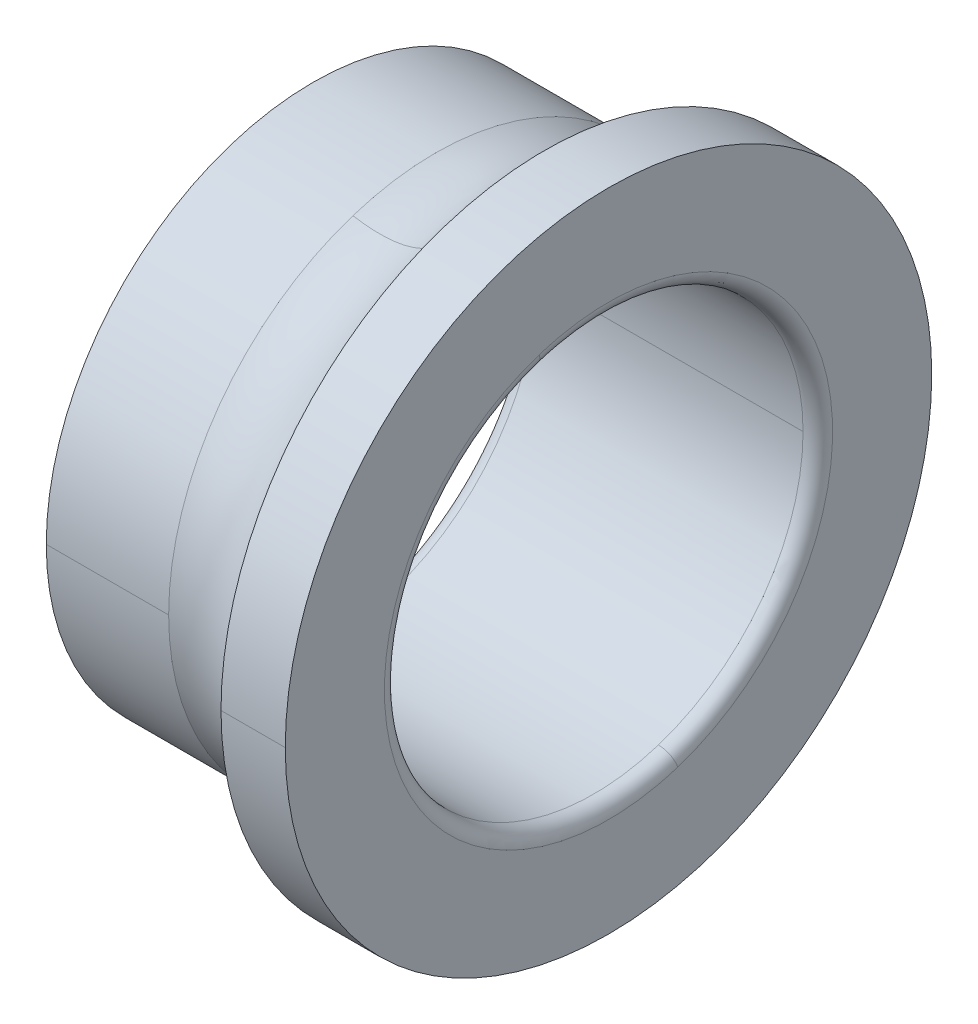
ISO-10303-21;
HEADER;
FILE_DESCRIPTION(('STEP AP214'),'2;1');
FILE_NAME('part.step','',(''),(''),'','','');
FILE_SCHEMA(('AUTOMOTIVE_DESIGN { 1 0 10303 214 1 1 1 1 }'));
ENDSEC;
DATA;
#1=APPLICATION_CONTEXT('core data for automotive mechanical design processes');
#2=APPLICATION_PROTOCOL_DEFINITION('international standard','automotive_design',2000,#1);
#3=PRODUCT_CONTEXT('',#1,'mechanical');
#4=PRODUCT('Part','Part','',(#3));
#5=PRODUCT_RELATED_PRODUCT_CATEGORY('part','',(#4));
#6=PRODUCT_DEFINITION_FORMATION('','',#4);
#7=PRODUCT_DEFINITION_CONTEXT('part definition',#1,'design');
#8=PRODUCT_DEFINITION('design','',#6,#7);
#9=PRODUCT_DEFINITION_SHAPE('','',#8);
#10=(LENGTH_UNIT() NAMED_UNIT(*) SI_UNIT(.MILLI.,.METRE.));
#11=(NAMED_UNIT(*) PLANE_ANGLE_UNIT() SI_UNIT($,.RADIAN.));
#12=(NAMED_UNIT(*) SI_UNIT($,.STERADIAN.) SOLID_ANGLE_UNIT());
#13=UNCERTAINTY_MEASURE_WITH_UNIT(LENGTH_MEASURE(1.E-05),#10,'distance_accuracy_value','');
#14=(GEOMETRIC_REPRESENTATION_CONTEXT(3) GLOBAL_UNCERTAINTY_ASSIGNED_CONTEXT((#13)) GLOBAL_UNIT_ASSIGNED_CONTEXT((#10,
#11,#12)) REPRESENTATION_CONTEXT('',''));
#15=CARTESIAN_POINT('',(0.,0.,0.));
#16=DIRECTION('',(0.,0.,1.));
#17=DIRECTION('',(1.,0.,0.));
#18=AXIS2_PLACEMENT_3D('',#15,#16,#17);
#19=CARTESIAN_POINT('',(12.,0.,0.));
#20=DIRECTION('',(1.,0.,0.));
#21=DIRECTION('',(0.,1.,0.));
#22=AXIS2_PLACEMENT_3D('',#19,#20,#21);
#23=CYLINDRICAL_SURFACE('',#22,10.83);
#24=DIRECTION('',(1.,0.,0.));
#25=VECTOR('',#24,1.);
#26=CARTESIAN_POINT('',(0.,0.,10.83));
#27=LINE('',#26,#25);
#28=CARTESIAN_POINT('',(0.,0.,10.83));
#29=VERTEX_POINT('',#28);
#30=CARTESIAN_POINT('',(4.969085842565,0.,10.83));
#31=VERTEX_POINT('',#30);
#32=EDGE_CURVE('E11',#29,#31,#27,.T.);
#33=ORIENTED_EDGE('',*,*,#32,.F.);
#34=CARTESIAN_POINT('',(0.,0.,0.));
#35=DIRECTION('',(1.,0.,0.));
#36=DIRECTION('',(0.,0.,-1.));
#37=AXIS2_PLACEMENT_3D('',#34,#35,#36);
#38=CIRCLE('',#37,10.83);
#39=CARTESIAN_POINT('',(0.,0.,-10.83));
#40=VERTEX_POINT('',#39);
#41=EDGE_CURVE('E25',#29,#40,#38,.T.);
#42=ORIENTED_EDGE('',*,*,#41,.T.);
#43=DIRECTION('',(1.,0.,0.));
#44=VECTOR('',#43,1.);
#45=CARTESIAN_POINT('',(0.,0.,-10.83));
#46=LINE('',#45,#44);
#47=CARTESIAN_POINT('',(4.969085842565,0.,-10.83));
#48=VERTEX_POINT('',#47);
#49=EDGE_CURVE('E379',#40,#48,#46,.T.);
#50=ORIENTED_EDGE('',*,*,#49,.T.);
#51=CARTESIAN_POINT('',(4.969085842565,0.,0.));
#52=DIRECTION('',(1.,0.,0.));
#53=DIRECTION('',(0.,0.,-1.));
#54=AXIS2_PLACEMENT_3D('',#51,#52,#53);
#55=CIRCLE('',#54,10.83);
#56=CARTESIAN_POINT('',(4.96908584256501,-10.2999420714765,-3.34665404908068));
#57=VERTEX_POINT('',#56);
#58=EDGE_CURVE('E373',#57,#48,#55,.T.);
#59=ORIENTED_EDGE('',*,*,#58,.F.);
#60=CARTESIAN_POINT('',(4.969085842565,0.,0.));
#61=DIRECTION('',(1.,0.,0.));
#62=DIRECTION('',(0.,0.,-1.));
#63=AXIS2_PLACEMENT_3D('',#60,#61,#62);
#64=CIRCLE('',#63,10.83);
#65=EDGE_CURVE('E367',#31,#57,#64,.T.);
#66=ORIENTED_EDGE('',*,*,#65,.F.);
#67=EDGE_LOOP('',(#33,#42,#50,#59,#66));
#68=FACE_BOUND('',#67,.T.);
#69=ADVANCED_FACE('F16',(#68),#23,.T.);
#70=CARTESIAN_POINT('',(5.99999999999977,0.,0.));
#71=DIRECTION('',(1.,0.,0.));
#72=DIRECTION('',(0.,0.309016994374947,-0.951056516295154));
#73=AXIS2_PLACEMENT_3D('',#70,#71,#72);
#74=TOROIDAL_SURFACE('',#73,14.2500000000004,3.57200000000031);
#75=CARTESIAN_POINT('',(5.99999999999977,-13.5525553572063,-4.40349216984313));
#76=DIRECTION('',(0.,0.309016994374947,-0.951056516295154));
#77=DIRECTION('',(-0.288609786515865,0.910586026240071,0.295867335039853));
#78=AXIS2_PLACEMENT_3D('',#75,#76,#77);
#79=CIRCLE('',#78,3.57200000000031);
#80=CARTESIAN_POINT('',(9.3902151849108,-12.4826167763739,-4.05584805117118));
#81=VERTEX_POINT('',#80);
#82=EDGE_CURVE('E362',#57,#81,#79,.T.);
#83=ORIENTED_EDGE('',*,*,#82,.T.);
#84=CARTESIAN_POINT('',(9.3902151849108,0.,0.));
#85=DIRECTION('',(1.,0.,0.));
#86=DIRECTION('',(0.,0.,-1.));
#87=AXIS2_PLACEMENT_3D('',#84,#85,#86);
#88=CIRCLE('',#87,13.125);
#89=CARTESIAN_POINT('',(9.3902151849108,0.,13.125));
#90=VERTEX_POINT('',#89);
#91=EDGE_CURVE('E135',#90,#81,#88,.T.);
#92=ORIENTED_EDGE('',*,*,#91,.F.);
#93=CARTESIAN_POINT('',(9.3902151849108,0.,0.));
#94=DIRECTION('',(1.,0.,0.));
#95=DIRECTION('',(0.,0.,-1.));
#96=AXIS2_PLACEMENT_3D('',#93,#94,#95);
#97=CIRCLE('',#96,13.125);
#98=CARTESIAN_POINT('',(9.3902151849108,12.4826167763739,4.05584805117119));
#99=VERTEX_POINT('',#98);
#100=EDGE_CURVE('E355',#99,#90,#97,.T.);
#101=ORIENTED_EDGE('',*,*,#100,.F.);
#102=CARTESIAN_POINT('',(5.99999999999977,13.5525553572063,4.40349216984313));
#103=DIRECTION('',(0.,-0.309016994374947,0.951056516295154));
#104=DIRECTION('',(-0.288609786515866,-0.91058602624007,-0.295867335039853));
#105=AXIS2_PLACEMENT_3D('',#102,#103,#104);
#106=CIRCLE('',#105,3.57200000000031);
#107=CARTESIAN_POINT('',(4.96908584256501,10.2999420714765,3.34665404908068));
#108=VERTEX_POINT('',#107);
#109=EDGE_CURVE('E146',#108,#99,#106,.T.);
#110=ORIENTED_EDGE('',*,*,#109,.F.);
#111=CARTESIAN_POINT('',(4.969085842565,0.,0.));
#112=DIRECTION('',(1.,0.,0.));
#113=DIRECTION('',(0.,0.,-1.));
#114=AXIS2_PLACEMENT_3D('',#111,#112,#113);
#115=CIRCLE('',#114,10.83);
#116=EDGE_CURVE('E346',#108,#31,#115,.T.);
#117=ORIENTED_EDGE('',*,*,#116,.T.);
#118=ORIENTED_EDGE('',*,*,#65,.T.);
#119=EDGE_LOOP('',(#83,#92,#101,#110,#117,#118));
#120=FACE_BOUND('',#119,.T.);
#121=ADVANCED_FACE('F432',(#120),#74,.F.);
#122=CARTESIAN_POINT('',(12.,0.,0.));
#123=DIRECTION('',(1.,0.,0.));
#124=DIRECTION('',(0.,-1.,0.));
#125=AXIS2_PLACEMENT_3D('',#122,#123,#124);
#126=CYLINDRICAL_SURFACE('',#125,10.83);
#127=ORIENTED_EDGE('',*,*,#32,.T.);
#128=ORIENTED_EDGE('',*,*,#116,.F.);
#129=CARTESIAN_POINT('',(4.969085842565,0.,0.));
#130=DIRECTION('',(1.,0.,0.));
#131=DIRECTION('',(0.,0.,-1.));
#132=AXIS2_PLACEMENT_3D('',#129,#130,#131);
#133=CIRCLE('',#132,10.83);
#134=EDGE_CURVE('E341',#48,#108,#133,.T.);
#135=ORIENTED_EDGE('',*,*,#134,.F.);
#136=ORIENTED_EDGE('',*,*,#49,.F.);
#137=CARTESIAN_POINT('',(0.,0.,0.));
#138=DIRECTION('',(1.,0.,0.));
#139=DIRECTION('',(0.,0.,-1.));
#140=AXIS2_PLACEMENT_3D('',#137,#138,#139);
#141=CIRCLE('',#140,10.83);
#142=EDGE_CURVE('E336',#40,#29,#141,.T.);
#143=ORIENTED_EDGE('',*,*,#142,.T.);
#144=EDGE_LOOP('',(#127,#128,#135,#136,#143));
#145=FACE_BOUND('',#144,.T.);
#146=ADVANCED_FACE('F316',(#145),#126,.T.);
#147=CARTESIAN_POINT('',(0.,10.83,0.));
#148=DIRECTION('',(-1.,0.,0.));
#149=DIRECTION('',(0.,0.,1.));
#150=AXIS2_PLACEMENT_3D('',#147,#148,#149);
#151=PLANE('',#150);
#152=CARTESIAN_POINT('',(0.,0.,0.));
#153=DIRECTION('',(1.,0.,0.));
#154=DIRECTION('',(0.,0.,-1.));
#155=AXIS2_PLACEMENT_3D('',#152,#153,#154);
#156=CIRCLE('',#155,9.1);
#157=CARTESIAN_POINT('',(0.,8.6546142982859,2.81205464881202));
#158=VERTEX_POINT('',#157);
#159=CARTESIAN_POINT('',(0.,-8.6546142982859,-2.81205464881202));
#160=VERTEX_POINT('',#159);
#161=EDGE_CURVE('E333',#158,#160,#156,.T.);
#162=ORIENTED_EDGE('',*,*,#161,.T.);
#163=CARTESIAN_POINT('',(0.,-8.6546142982859,-2.81205464881202));
#164=CARTESIAN_POINT('',(0.,-7.77035322156963,-5.52977285694612));
#165=CARTESIAN_POINT('',(0.,-5.82361355448477,-7.90801404603314));
#166=CARTESIAN_POINT('',(0.,-2.97302640379702,-9.35676213057699));
#167=CARTESIAN_POINT('',(0.,3.15812466204302,-9.71970828071693));
#168=CARTESIAN_POINT('',(0.,7.90499567495906,-5.82227850113272));
#169=CARTESIAN_POINT('',(0.,9.35961636543055,-2.97468359261989));
#170=CARTESIAN_POINT('',(0.,9.53666674238609,0.0936188124392139));
#171=CARTESIAN_POINT('',(0.,8.6546142982859,2.81205464881202));
#172=B_SPLINE_CURVE_WITH_KNOTS('',5,(#163,#164,#165,#166,#167,#168,#169,#170,#171),
.UNSPECIFIED.,.F.,.F.,(6,3,6),(0.,1.5707963267949,3.14159265358979),.UNSPECIFIED.);
#173=EDGE_CURVE('E331',#160,#158,#172,.T.);
#174=ORIENTED_EDGE('',*,*,#173,.T.);
#175=EDGE_LOOP('',(#162,#174));
#176=FACE_BOUND('',#175,.T.);
#177=ORIENTED_EDGE('',*,*,#41,.F.);
#178=ORIENTED_EDGE('',*,*,#142,.F.);
#179=EDGE_LOOP('',(#177,#178));
#180=FACE_BOUND('',#179,.T.);
#181=ADVANCED_FACE('F310',(#176,#180),#151,.T.);
#182=CARTESIAN_POINT('',(0.600000000000048,0.,0.));
#183=DIRECTION('',(1.,0.,0.));
#184=DIRECTION('',(0.,-0.309016994374947,0.951056516295154));
#185=AXIS2_PLACEMENT_3D('',#182,#183,#184);
#186=TOROIDAL_SURFACE('',#185,9.1,0.600000000000048);
#187=CARTESIAN_POINT('',(0.600000000000048,-8.6546142982859,-2.81205464881202));
#188=DIRECTION('',(0.,0.309016994374947,-0.951056516295154));
#189=DIRECTION('',(-1.,0.,0.));
#190=AXIS2_PLACEMENT_3D('',#187,#188,#189);
#191=CIRCLE('',#190,0.600000000000048);
#192=CARTESIAN_POINT('',(0.600000000000001,-8.08398038850876,-2.62664445218704));
#193=VERTEX_POINT('',#192);
#194=EDGE_CURVE('E393',#160,#193,#191,.T.);
#195=ORIENTED_EDGE('',*,*,#194,.T.);
#196=CARTESIAN_POINT('',(0.6,0.,0.));
#197=DIRECTION('',(1.,0.,0.));
#198=DIRECTION('',(0.,0.,-1.));
#199=AXIS2_PLACEMENT_3D('',#196,#197,#198);
#200=CIRCLE('',#199,8.5);
#201=CARTESIAN_POINT('',(0.6,0.,-8.5));
#202=VERTEX_POINT('',#201);
#203=EDGE_CURVE('E394',#193,#202,#200,.T.);
#204=ORIENTED_EDGE('',*,*,#203,.T.);
#205=CARTESIAN_POINT('',(0.6,0.,0.));
#206=DIRECTION('',(1.,0.,0.));
#207=DIRECTION('',(0.,0.,-1.));
#208=AXIS2_PLACEMENT_3D('',#205,#206,#207);
#209=CIRCLE('',#208,8.5);
#210=CARTESIAN_POINT('',(0.6,8.08398038850876,2.62664445218704));
#211=VERTEX_POINT('',#210);
#212=EDGE_CURVE('E395',#202,#211,#209,.T.);
#213=ORIENTED_EDGE('',*,*,#212,.T.);
#214=CARTESIAN_POINT('',(0.600000000000048,8.6546142982859,2.81205464881202));
#215=DIRECTION('',(0.,-0.309016994374947,0.951056516295154));
#216=DIRECTION('',(-1.,0.,0.));
#217=AXIS2_PLACEMENT_3D('',#214,#215,#216);
#218=CIRCLE('',#217,0.600000000000048);
#219=EDGE_CURVE('E290',#158,#211,#218,.T.);
#220=ORIENTED_EDGE('',*,*,#219,.F.);
#221=ORIENTED_EDGE('',*,*,#173,.F.);
#222=EDGE_LOOP('',(#195,#204,#213,#220,#221));
#223=FACE_BOUND('',#222,.T.);
#224=ADVANCED_FACE('F299',(#223),#186,.T.);
#225=CARTESIAN_POINT('',(0.600000000000048,0.,0.));
#226=DIRECTION('',(1.,0.,0.));
#227=DIRECTION('',(0.,0.309016994374947,-0.951056516295154));
#228=AXIS2_PLACEMENT_3D('',#225,#226,#227);
#229=TOROIDAL_SURFACE('',#228,9.1,0.600000000000048);
#230=ORIENTED_EDGE('',*,*,#194,.F.);
#231=ORIENTED_EDGE('',*,*,#161,.F.);
#232=ORIENTED_EDGE('',*,*,#219,.T.);
#233=CARTESIAN_POINT('',(0.6,0.,0.));
#234=DIRECTION('',(1.,0.,0.));
#235=DIRECTION('',(0.,0.,-1.));
#236=AXIS2_PLACEMENT_3D('',#233,#234,#235);
#237=CIRCLE('',#236,8.5);
#238=CARTESIAN_POINT('',(0.6,0.,8.5));
#239=VERTEX_POINT('',#238);
#240=EDGE_CURVE('E285',#211,#239,#237,.T.);
#241=ORIENTED_EDGE('',*,*,#240,.T.);
#242=CARTESIAN_POINT('',(0.6,0.,0.));
#243=DIRECTION('',(1.,0.,0.));
#244=DIRECTION('',(0.,0.,-1.));
#245=AXIS2_PLACEMENT_3D('',#242,#243,#244);
#246=CIRCLE('',#245,8.5);
#247=EDGE_CURVE('E279',#239,#193,#246,.T.);
#248=ORIENTED_EDGE('',*,*,#247,.T.);
#249=EDGE_LOOP('',(#230,#231,#232,#241,#248));
#250=FACE_BOUND('',#249,.T.);
#251=ADVANCED_FACE('F309',(#250),#229,.T.);
#252=CARTESIAN_POINT('',(12.,0.,0.));
#253=DIRECTION('',(1.,0.,0.));
#254=DIRECTION('',(0.,1.,0.));
#255=AXIS2_PLACEMENT_3D('',#252,#253,#254);
#256=CYLINDRICAL_SURFACE('',#255,8.5);
#257=DIRECTION('',(1.,0.,0.));
#258=VECTOR('',#257,1.);
#259=CARTESIAN_POINT('',(0.6,0.,8.5));
#260=LINE('',#259,#258);
#261=CARTESIAN_POINT('',(11.4,0.,8.5));
#262=VERTEX_POINT('',#261);
#263=EDGE_CURVE('E274',#239,#262,#260,.T.);
#264=ORIENTED_EDGE('',*,*,#263,.T.);
#265=CARTESIAN_POINT('',(11.4,0.,0.));
#266=DIRECTION('',(1.,0.,0.));
#267=DIRECTION('',(0.,0.,-1.));
#268=AXIS2_PLACEMENT_3D('',#265,#266,#267);
#269=CIRCLE('',#268,8.5);
#270=CARTESIAN_POINT('',(11.4,-8.08398038850888,-2.62664445218707));
#271=VERTEX_POINT('',#270);
#272=EDGE_CURVE('E270',#262,#271,#269,.T.);
#273=ORIENTED_EDGE('',*,*,#272,.T.);
#274=CARTESIAN_POINT('',(11.4,0.,0.));
#275=DIRECTION('',(1.,0.,0.));
#276=DIRECTION('',(0.,0.,-1.));
#277=AXIS2_PLACEMENT_3D('',#274,#275,#276);
#278=CIRCLE('',#277,8.5);
#279=CARTESIAN_POINT('',(11.4,0.,-8.5));
#280=VERTEX_POINT('',#279);
#281=EDGE_CURVE('E265',#271,#280,#278,.T.);
#282=ORIENTED_EDGE('',*,*,#281,.T.);
#283=DIRECTION('',(1.,0.,0.));
#284=VECTOR('',#283,1.);
#285=CARTESIAN_POINT('',(0.6,0.,-8.5));
#286=LINE('',#285,#284);
#287=EDGE_CURVE('E260',#202,#280,#286,.T.);
#288=ORIENTED_EDGE('',*,*,#287,.F.);
#289=ORIENTED_EDGE('',*,*,#203,.F.);
#290=ORIENTED_EDGE('',*,*,#247,.F.);
#291=EDGE_LOOP('',(#264,#273,#282,#288,#289,#290));
#292=FACE_BOUND('',#291,.T.);
#293=ADVANCED_FACE('F422',(#292),#256,.F.);
#294=CARTESIAN_POINT('',(12.,0.,0.));
#295=DIRECTION('',(1.,0.,0.));
#296=DIRECTION('',(0.,-1.,0.));
#297=AXIS2_PLACEMENT_3D('',#294,#295,#296);
#298=CYLINDRICAL_SURFACE('',#297,8.5);
#299=ORIENTED_EDGE('',*,*,#263,.F.);
#300=ORIENTED_EDGE('',*,*,#240,.F.);
#301=ORIENTED_EDGE('',*,*,#212,.F.);
#302=ORIENTED_EDGE('',*,*,#287,.T.);
#303=CARTESIAN_POINT('',(11.4,0.,0.));
#304=DIRECTION('',(1.,0.,0.));
#305=DIRECTION('',(0.,0.,-1.));
#306=AXIS2_PLACEMENT_3D('',#303,#304,#305);
#307=CIRCLE('',#306,8.5);
#308=CARTESIAN_POINT('',(11.4,8.08398038850888,2.62664445218708));
#309=VERTEX_POINT('',#308);
#310=EDGE_CURVE('E255',#280,#309,#307,.T.);
#311=ORIENTED_EDGE('',*,*,#310,.T.);
#312=CARTESIAN_POINT('',(11.4,0.,0.));
#313=DIRECTION('',(1.,0.,0.));
#314=DIRECTION('',(0.,0.,-1.));
#315=AXIS2_PLACEMENT_3D('',#312,#313,#314);
#316=CIRCLE('',#315,8.5);
#317=EDGE_CURVE('E249',#309,#262,#316,.T.);
#318=ORIENTED_EDGE('',*,*,#317,.T.);
#319=EDGE_LOOP('',(#299,#300,#301,#302,#311,#318));
#320=FACE_BOUND('',#319,.T.);
#321=ADVANCED_FACE('F417',(#320),#298,.F.);
#322=CARTESIAN_POINT('',(11.4,0.,0.));
#323=DIRECTION('',(1.,0.,0.));
#324=DIRECTION('',(0.,0.309016994374947,-0.951056516295154));
#325=AXIS2_PLACEMENT_3D('',#322,#323,#324);
#326=TOROIDAL_SURFACE('',#325,9.1,0.599999999999927);
#327=CARTESIAN_POINT('',(11.4,-8.6546142982859,-2.81205464881202));
#328=DIRECTION('',(0.,0.309016994374947,-0.951056516295154));
#329=DIRECTION('',(0.,0.951056516295154,0.309016994374947));
#330=AXIS2_PLACEMENT_3D('',#327,#328,#329);
#331=CIRCLE('',#330,0.599999999999927);
#332=CARTESIAN_POINT('',(11.9999999999999,-8.6546142982859,-2.81205464881202));
#333=VERTEX_POINT('',#332);
#334=EDGE_CURVE('E223',#271,#333,#331,.T.);
#335=ORIENTED_EDGE('',*,*,#334,.F.);
#336=ORIENTED_EDGE('',*,*,#272,.F.);
#337=ORIENTED_EDGE('',*,*,#317,.F.);
#338=CARTESIAN_POINT('',(11.4,8.6546142982859,2.81205464881202));
#339=DIRECTION('',(0.,-0.309016994374947,0.951056516295154));
#340=DIRECTION('',(0.,-0.951056516295154,-0.309016994374947));
#341=AXIS2_PLACEMENT_3D('',#338,#339,#340);
#342=CIRCLE('',#341,0.599999999999927);
#343=CARTESIAN_POINT('',(11.9999999999999,8.6546142982859,2.81205464881202));
#344=VERTEX_POINT('',#343);
#345=EDGE_CURVE('E219',#309,#344,#342,.T.);
#346=ORIENTED_EDGE('',*,*,#345,.T.);
#347=CARTESIAN_POINT('',(11.9999999999999,8.65461429828589,2.81205464881204));
#348=CARTESIAN_POINT('',(11.9999999999999,8.60860511914574,2.95366656315673));
#349=CARTESIAN_POINT('',(11.9999999999999,8.55911447032686,3.09414699684201));
#350=CARTESIAN_POINT('',(11.9999999999999,8.45330243894805,3.37251140646159));
#351=CARTESIAN_POINT('',(11.9999999999999,8.39698105638814,3.51039538239588));
#352=CARTESIAN_POINT('',(11.9999999999999,8.27763976314372,3.78323338008131));
#353=CARTESIAN_POINT('',(11.9999999999999,8.21461985245923,3.91818740183245));
#354=CARTESIAN_POINT('',(11.9999999999999,8.08203425525104,4.1848407292831));
#355=CARTESIAN_POINT('',(11.9999999999999,8.01246856872733,4.3165400349826));
#356=CARTESIAN_POINT('',(11.9999999999999,7.86695875999756,4.576366560262));
#357=CARTESIAN_POINT('',(11.9999999999999,7.79101463779149,4.70449377984189));
#358=CARTESIAN_POINT('',(11.9999999999999,7.63293098063957,4.9568674886172));
#359=CARTESIAN_POINT('',(11.9999999999999,7.55079144569371,5.08111397781262));
#360=CARTESIAN_POINT('',(11.9999999999999,7.38051482647062,5.32542689832994));
#361=CARTESIAN_POINT('',(11.9999999999999,7.29237774219337,5.44549332965184));
#362=CARTESIAN_POINT('',(11.9999999999999,7.11031835906663,5.68115688569824));
#363=CARTESIAN_POINT('',(11.9999999999999,7.01639606021713,5.79675401042276));
#364=CARTESIAN_POINT('',(11.9999999999999,6.82299251370341,6.02320046918661));
#365=CARTESIAN_POINT('',(11.9999999999999,6.7235112660392,6.13404980322595));
#366=CARTESIAN_POINT('',(11.9999999999999,6.51922948128005,6.35073363499558));
#367=CARTESIAN_POINT('',(11.9999999999999,6.41442894418512,6.45656813272588));
#368=CARTESIAN_POINT('',(11.9999999999999,6.19976105414544,6.66296732726726));
#369=CARTESIAN_POINT('',(11.9999999999999,6.08989370120069,6.76353202407835));
#370=CARTESIAN_POINT('',(11.9999999999999,5.86535685956264,6.95914934762769));
#371=CARTESIAN_POINT('',(11.9999999999999,5.75068737086933,7.05420197436594));
#372=CARTESIAN_POINT('',(11.9999999999999,5.51682250656963,7.23856616766363));
#373=CARTESIAN_POINT('',(11.9999999999999,5.39762713096324,7.32787773422308));
#374=CARTESIAN_POINT('',(11.9999999999999,5.15499764493929,7.50054464777724));
#375=CARTESIAN_POINT('',(11.9999999999999,5.03156353452172,7.58389999477195));
#376=CARTESIAN_POINT('',(11.9999999999999,4.78075394245847,7.74445365886448));
#377=CARTESIAN_POINT('',(11.9999999999999,4.65337846081279,7.82165197596229));
#378=CARTESIAN_POINT('',(11.9999999999999,4.3949929849855,7.96970560275342));
#379=CARTESIAN_POINT('',(11.9999999999999,4.2639829908039,8.04056091244673));
#380=CARTESIAN_POINT('',(11.9999999999999,3.99864410445583,8.17575782778158));
#381=CARTESIAN_POINT('',(11.9999999999999,3.86431521228938,8.24009943342312));
#382=CARTESIAN_POINT('',(11.9999999999999,3.59266214003866,8.3621139360908));
#383=CARTESIAN_POINT('',(11.9999999999999,3.45533795995441,8.41978683311693));
#384=CARTESIAN_POINT('',(11.9999999999999,3.1780251378461,8.5283249794933));
#385=CARTESIAN_POINT('',(11.9999999999999,3.03803649582205,8.57919022884354));
#386=CARTESIAN_POINT('',(11.9999999999999,2.75573199473434,8.67399054102716));
#387=CARTESIAN_POINT('',(11.9999999999999,2.61341613567068,8.71792560386054));
#388=CARTESIAN_POINT('',(11.9999999999999,2.32680005187365,8.79875969959584));
#389=CARTESIAN_POINT('',(11.9999999999999,2.18249982714027,8.83565873249775));
#390=CARTESIAN_POINT('',(11.9999999999999,1.89226264388438,8.90233187536787));
#391=CARTESIAN_POINT('',(11.9999999999999,1.74632568536187,8.93210598533607));
#392=CARTESIAN_POINT('',(11.9999999999999,1.45316660944336,8.98445755389996));
#393=CARTESIAN_POINT('',(11.9999999999999,1.30594449204736,9.00703501249564));
#394=CARTESIAN_POINT('',(11.9999999999999,1.01056976935783,9.04493888723916));
#395=CARTESIAN_POINT('',(11.9999999999999,0.862417164064294,9.060265303387));
#396=CARTESIAN_POINT('',(11.9999999999999,0.565538378182463,9.08363017055592));
#397=CARTESIAN_POINT('',(11.9999999999999,0.41681219759417,9.091668621577));
#398=CARTESIAN_POINT('',(11.9999999999999,0.119144555518741,9.10043819315979));
#399=CARTESIAN_POINT('',(11.9999999999999,-0.0297969059683946,9.1011693137215));
#400=CARTESIAN_POINT('',(11.9999999999999,-0.327536296815056,9.09532246305208));
#401=CARTESIAN_POINT('',(11.9999999999999,-0.476334226174581,9.08874449182095));
#402=CARTESIAN_POINT('',(11.9999999999999,-0.773428085521034,9.06829530447473));
#403=CARTESIAN_POINT('',(11.9999999999999,-0.921724015507962,9.05442408835962));
#404=CARTESIAN_POINT('',(11.9999999999999,-1.21745661822469,9.01942182822004));
#405=CARTESIAN_POINT('',(11.9999999999999,-1.3648932909545,8.99829078419555));
#406=CARTESIAN_POINT('',(11.9999999999999,-1.65855219129844,8.94881977477311));
#407=CARTESIAN_POINT('',(11.9999999999999,-1.80477441891259,8.92047980937516));
#408=CARTESIAN_POINT('',(11.9999999999999,-2.09565216687134,8.85665923066472));
#409=CARTESIAN_POINT('',(11.9999999999999,-2.24030768721596,8.82117861735223));
#410=CARTESIAN_POINT('',(11.9999999999999,-2.5277035328168,8.74316221871793));
#411=CARTESIAN_POINT('',(11.9999999999999,-2.67044385807303,8.70062643339611));
#412=CARTESIAN_POINT('',(11.9999999999999,-2.95366543955102,8.60860216317568));
#413=CARTESIAN_POINT('',(11.9999999999999,-3.09414669577276,8.55911367827707));
#414=CARTESIAN_POINT('',(11.9999999999999,-3.37251170753082,8.45330323099785));
#415=CARTESIAN_POINT('',(11.9999999999999,-3.51039546306713,8.39698126861724));
#416=CARTESIAN_POINT('',(11.9999999999999,-3.78323329941004,8.27763955091463));
#417=CARTESIAN_POINT('',(11.9999999999999,-3.91818738021664,8.21461979559262));
#418=CARTESIAN_POINT('',(11.9999999999999,-4.18484075089888,8.08203431211766));
#419=CARTESIAN_POINT('',(11.9999999999999,-4.31654004077453,8.01246858396471));
#420=CARTESIAN_POINT('',(11.9999999999999,-4.57636655447005,7.8669587447602));
#421=CARTESIAN_POINT('',(11.9999999999999,-4.70449377828993,7.79101463370866));
#422=CARTESIAN_POINT('',(11.9999999999999,-4.95686749016913,7.63293098472241));
#423=CARTESIAN_POINT('',(11.9999999999999,-5.08111397822846,7.55079144678772));
#424=CARTESIAN_POINT('',(11.9999999999999,-5.32542689791409,7.38051482537663));
#425=CARTESIAN_POINT('',(11.9999999999999,-5.4454933295404,7.29237774190024));
#426=CARTESIAN_POINT('',(11.9999999999999,-5.68115688580966,7.11031835935977));
#427=CARTESIAN_POINT('',(11.9999999999999,-5.7967540104526,7.01639606029568));
#428=CARTESIAN_POINT('',(11.9999999999999,-6.02320046915674,6.82299251362488));
#429=CARTESIAN_POINT('',(11.9999999999999,-6.13404980321794,6.72351126601816));
#430=CARTESIAN_POINT('',(11.9999999999999,-6.35073363500357,6.5192294813011));
#431=CARTESIAN_POINT('',(11.9999999999999,-6.45656813272801,6.41442894419076));
#432=CARTESIAN_POINT('',(11.9999999999999,-6.66296732726511,6.19976105413981));
#433=CARTESIAN_POINT('',(11.9999999999999,-6.76353202407777,6.08989370119919));
#434=CARTESIAN_POINT('',(11.9999999999999,-6.95914934762826,5.86535685956416));
#435=CARTESIAN_POINT('',(11.9999999999999,-7.05420197436608,5.75068737086975));
#436=CARTESIAN_POINT('',(11.9999999999999,-7.23856616766347,5.51682250656924));
#437=CARTESIAN_POINT('',(11.9999999999999,-7.32787773422303,5.39762713096315));
#438=CARTESIAN_POINT('',(11.9999999999999,-7.50054464777727,5.15499764493941));
#439=CARTESIAN_POINT('',(11.9999999999999,-7.58389999477195,5.03156353452176));
#440=CARTESIAN_POINT('',(11.9999999999999,-7.74445365886446,4.78075394245845));
#441=CARTESIAN_POINT('',(11.9999999999999,-7.82165197596228,4.65337846081279));
#442=CARTESIAN_POINT('',(11.9999999999999,-7.96970560275342,4.39499298498552));
#443=CARTESIAN_POINT('',(11.9999999999999,-8.04056091244673,4.26398299080391));
#444=CARTESIAN_POINT('',(11.9999999999999,-8.17575782778157,3.99864410445584));
#445=CARTESIAN_POINT('',(11.9999999999999,-8.24009943342311,3.86431521228939));
#446=CARTESIAN_POINT('',(11.9999999999999,-8.3621139360908,3.59266214003867));
#447=CARTESIAN_POINT('',(11.9999999999999,-8.41978683311696,3.45533795995441));
#448=CARTESIAN_POINT('',(11.9999999999999,-8.52832497949327,3.17802513784612));
#449=CARTESIAN_POINT('',(11.9999999999999,-8.57919022884342,3.03803649582209));
#450=CARTESIAN_POINT('',(11.9999999999999,-8.67399054102727,2.75573199473432));
#451=CARTESIAN_POINT('',(11.9999999999999,-8.71792560386096,2.61341613567058));
#452=CARTESIAN_POINT('',(11.9999999999999,-8.79875969959542,2.32680005187377));
#453=CARTESIAN_POINT('',(11.9999999999999,-8.83565873249619,2.1824998271407));
#454=CARTESIAN_POINT('',(11.9999999999999,-8.90233187536943,1.89226264388397));
#455=CARTESIAN_POINT('',(11.9999999999999,-8.9321059853419,1.7463256853603));
#456=CARTESIAN_POINT('',(11.9999999999999,-8.98445755389413,1.45316660944496));
#457=CARTESIAN_POINT('',(11.9999999999999,-9.00703501247391,1.30594449205328));
#458=CARTESIAN_POINT('',(11.9999999999999,-9.04493888726089,1.01056976935195));
#459=CARTESIAN_POINT('',(11.9999999999999,-9.0602653034681,0.862417164042297));
#460=CARTESIAN_POINT('',(11.9999999999999,-9.08363017047483,0.565538378204493));
#461=CARTESIAN_POINT('',(11.9999999999999,-9.09166862127435,0.416812197676342));
#462=CARTESIAN_POINT('',(11.9999999999999,-9.10043819346243,0.119144555436602));
#463=CARTESIAN_POINT('',(11.9999999999999,-9.10116931485098,-0.0297969062749878));
#464=CARTESIAN_POINT('',(11.9999999999999,-9.0953224619226,-0.327536296508429));
#465=CARTESIAN_POINT('',(11.9999999999999,-9.08874448760566,-0.476334225030281));
#466=CARTESIAN_POINT('',(11.9999999999999,-9.06829530869003,-0.773428086665303));
#467=CARTESIAN_POINT('',(11.9999999999999,-9.05442410409133,-0.921724019778474));
#468=CARTESIAN_POINT('',(11.9999999999999,-9.01942181248834,-1.21745661395416));
#469=CARTESIAN_POINT('',(11.9999999999999,-8.99829072548404,-1.36489327501668));
#470=CARTESIAN_POINT('',(11.9999999999999,-8.94881983348462,-1.65855220723624));
#471=CARTESIAN_POINT('',(11.9999999999999,-8.92048002848949,-1.80477447839329));
#472=CARTESIAN_POINT('',(11.9999999999999,-8.85665901155039,-2.09565210739062));
#473=CARTESIAN_POINT('',(11.9999999999999,-8.82117779960643,-2.24030746523089));
#474=CARTESIAN_POINT('',(11.9999999999999,-8.74316303646373,-2.52770375480184));
#475=CARTESIAN_POINT('',(11.9999999999999,-8.700629485265,-2.67044468653252));
#476=CARTESIAN_POINT('',(11.9999999999999,-8.6546142982859,-2.81205464881201));
#477=B_SPLINE_CURVE_WITH_KNOTS('',3,(#347,#348,#349,#350,#351,#352,#353,#354,#355,#356,#357,
#358,#359,#360,#361,#362,#363,#364,#365,#366,#367,#368,#369,#370,#371,#372,#373,#374,#375,#376,
#377,#378,#379,#380,#381,#382,#383,#384,#385,#386,#387,#388,#389,#390,#391,#392,#393,#394,#395,
#396,#397,#398,#399,#400,#401,#402,#403,#404,#405,#406,#407,#408,#409,#410,#411,#412,#413,#414,
#415,#416,#417,#418,#419,#420,#421,#422,#423,#424,#425,#426,#427,#428,#429,#430,#431,#432,#433,
#434,#435,#436,#437,#438,#439,#440,#441,#442,#443,#444,#445,#446,#447,#448,#449,#450,#451,#452,
#453,#454,#455,#456,#457,#458,#459,#460,#461,#462,#463,#464,#465,#466,#467,#468,#469,#470,#471,
#472,#473,#474,#475,#476),.UNSPECIFIED.,.F.,.F.,(4,2,2,2,2,2,2,2,2,2,2,2,2,2,2,2,2,2,2,2,2,2,2,
2,2,2,2,2,2,2,2,2,2,2,2,2,2,2,2,2,2,2,2,2,2,2,2,2,2,2,2,2,2,2,2,2,2,2,2,2,2,2,2,2,4),(0.,
0.446650359117002,0.893300718234006,1.33995107735101,1.78660143646801,2.23325179558501,
2.67990215470202,3.12655251381902,3.57320287293603,4.01985323205303,4.46650359117003,
4.91315395028704,5.35980430940404,5.80645466852104,6.25310502763804,6.69975538675505,
7.14640574587205,7.59305610498905,8.03970646410606,8.48635682322306,8.93300718234006,
9.37965754145707,9.82630790057408,10.2729582596911,10.7196086188081,11.1662589779251,
11.6129093370421,12.0595596961591,12.5062100552761,12.9528604143931,13.3995107735101,
13.8461611326271,14.2928114917441,14.7394618508611,15.1861122099781,15.6327625690951,
16.0794129282121,16.5260632873291,16.9727136464461,17.4193640055631,17.8660143646801,
18.3126647237971,18.7593150829141,19.2059654420311,19.6526158011481,20.0992661602651,
20.5459165193821,20.9925668784992,21.4392172376162,21.8858675967332,22.3325179558502,
22.7791683149672,23.2258186740842,23.6724690332012,24.1191193923182,24.5657697514352,
25.0124201105522,25.4590704696692,25.9057208287862,26.3523711879032,26.7990215470202,
27.2456719061372,27.6923222652542,28.1389726243712,28.5856229834882),.UNSPECIFIED.);
#478=EDGE_CURVE('E213',#344,#333,#477,.T.);
#479=ORIENTED_EDGE('',*,*,#478,.T.);
#480=EDGE_LOOP('',(#335,#336,#337,#346,#479));
#481=FACE_BOUND('',#480,.T.);
#482=ADVANCED_FACE('F193',(#481),#326,.T.);
#483=CARTESIAN_POINT('',(12.,9.1,0.));
#484=DIRECTION('',(1.,0.,0.));
#485=DIRECTION('',(0.,0.,-1.));
#486=AXIS2_PLACEMENT_3D('',#483,#484,#485);
#487=PLANE('',#486);
#488=CARTESIAN_POINT('',(12.,0.,0.));
#489=DIRECTION('',(1.,0.,0.));
#490=DIRECTION('',(0.,0.,-1.));
#491=AXIS2_PLACEMENT_3D('',#488,#489,#490);
#492=CIRCLE('',#491,13.125);
#493=CARTESIAN_POINT('',(12.,0.,-13.125));
#494=VERTEX_POINT('',#493);
#495=CARTESIAN_POINT('',(12.,0.,13.125));
#496=VERTEX_POINT('',#495);
#497=EDGE_CURVE('E154',#494,#496,#492,.T.);
#498=ORIENTED_EDGE('',*,*,#497,.T.);
#499=CARTESIAN_POINT('',(12.,0.,0.));
#500=DIRECTION('',(1.,0.,0.));
#501=DIRECTION('',(0.,0.,-1.));
#502=AXIS2_PLACEMENT_3D('',#499,#500,#501);
#503=CIRCLE('',#502,13.125);
#504=EDGE_CURVE('E226',#496,#494,#503,.T.);
#505=ORIENTED_EDGE('',*,*,#504,.T.);
#506=EDGE_LOOP('',(#498,#505));
#507=FACE_BOUND('',#506,.T.);
#508=CARTESIAN_POINT('',(11.9999999999999,-8.65461429828589,-2.81205464881204));
#509=CARTESIAN_POINT('',(11.9999999999999,-8.60860511914574,-2.95366656315673));
#510=CARTESIAN_POINT('',(11.9999999999999,-8.55911447032686,-3.09414699684201));
#511=CARTESIAN_POINT('',(11.9999999999999,-8.45330243894805,-3.37251140646159));
#512=CARTESIAN_POINT('',(11.9999999999999,-8.39698105638814,-3.51039538239588));
#513=CARTESIAN_POINT('',(11.9999999999999,-8.27763976314372,-3.78323338008131));
#514=CARTESIAN_POINT('',(11.9999999999999,-8.21461985245923,-3.91818740183245));
#515=CARTESIAN_POINT('',(11.9999999999999,-8.08203425525104,-4.18484072928309));
#516=CARTESIAN_POINT('',(11.9999999999999,-8.01246856872733,-4.3165400349826));
#517=CARTESIAN_POINT('',(11.9999999999999,-7.86695875999756,-4.576366560262));
#518=CARTESIAN_POINT('',(11.9999999999999,-7.79101463779149,-4.70449377984189));
#519=CARTESIAN_POINT('',(11.9999999999999,-7.63293098063957,-4.9568674886172));
#520=CARTESIAN_POINT('',(11.9999999999999,-7.55079144569372,-5.08111397781262));
#521=CARTESIAN_POINT('',(11.9999999999999,-7.38051482647062,-5.32542689832994));
#522=CARTESIAN_POINT('',(11.9999999999999,-7.29237774219337,-5.44549332965183));
#523=CARTESIAN_POINT('',(11.9999999999999,-7.11031835906663,-5.68115688569824));
#524=CARTESIAN_POINT('',(11.9999999999999,-7.01639606021713,-5.79675401042275));
#525=CARTESIAN_POINT('',(11.9999999999999,-6.82299251370342,-6.0232004691866));
#526=CARTESIAN_POINT('',(11.9999999999999,-6.7235112660392,-6.13404980322594));
#527=CARTESIAN_POINT('',(11.9999999999999,-6.51922948128005,-6.35073363499558));
#528=CARTESIAN_POINT('',(11.9999999999999,-6.41442894418512,-6.45656813272587));
#529=CARTESIAN_POINT('',(11.9999999999999,-6.19976105414544,-6.66296732726726));
#530=CARTESIAN_POINT('',(11.9999999999999,-6.0898937012007,-6.76353202407835));
#531=CARTESIAN_POINT('',(11.9999999999999,-5.86535685956264,-6.95914934762768));
#532=CARTESIAN_POINT('',(11.9999999999999,-5.75068737086933,-7.05420197436593));
#533=CARTESIAN_POINT('',(11.9999999999999,-5.51682250656963,-7.23856616766363));
#534=CARTESIAN_POINT('',(11.9999999999999,-5.39762713096325,-7.32787773422308));
#535=CARTESIAN_POINT('',(11.9999999999999,-5.15499764493929,-7.50054464777724));
#536=CARTESIAN_POINT('',(11.9999999999999,-5.03156353452172,-7.58389999477195));
#537=CARTESIAN_POINT('',(11.9999999999999,-4.78075394245847,-7.74445365886447));
#538=CARTESIAN_POINT('',(11.9999999999999,-4.65337846081279,-7.82165197596229));
#539=CARTESIAN_POINT('',(11.9999999999999,-4.39499298498551,-7.96970560275341));
#540=CARTESIAN_POINT('',(11.9999999999999,-4.2639829908039,-8.04056091244672));
#541=CARTESIAN_POINT('',(11.9999999999999,-3.99864410445584,-8.17575782778157));
#542=CARTESIAN_POINT('',(11.9999999999999,-3.86431521228938,-8.24009943342312));
#543=CARTESIAN_POINT('',(11.9999999999999,-3.59266214003867,-8.3621139360908));
#544=CARTESIAN_POINT('',(11.9999999999999,-3.45533795995441,-8.41978683311693));
#545=CARTESIAN_POINT('',(11.9999999999999,-3.17802513784611,-8.52832497949329));
#546=CARTESIAN_POINT('',(11.9999999999999,-3.03803649582205,-8.57919022884353));
#547=CARTESIAN_POINT('',(11.9999999999999,-2.75573199473435,-8.67399054102716));
#548=CARTESIAN_POINT('',(11.9999999999999,-2.61341613567069,-8.71792560386054));
#549=CARTESIAN_POINT('',(11.9999999999999,-2.32680005187366,-8.79875969959584));
#550=CARTESIAN_POINT('',(11.9999999999999,-2.18249982714028,-8.83565873249775));
#551=CARTESIAN_POINT('',(11.9999999999999,-1.89226264388439,-8.90233187536787));
#552=CARTESIAN_POINT('',(11.9999999999999,-1.74632568536188,-8.93210598533607));
#553=CARTESIAN_POINT('',(11.9999999999999,-1.45316660944338,-8.98445755389995));
#554=CARTESIAN_POINT('',(11.9999999999999,-1.30594449204738,-9.00703501249563));
#555=CARTESIAN_POINT('',(11.9999999999999,-1.01056976935785,-9.04493888723916));
#556=CARTESIAN_POINT('',(11.9999999999999,-0.862417164064308,-9.060265303387));
#557=CARTESIAN_POINT('',(11.9999999999999,-0.565538378182475,-9.08363017055592));
#558=CARTESIAN_POINT('',(11.9999999999999,-0.41681219759418,-9.091668621577));
#559=CARTESIAN_POINT('',(11.9999999999999,-0.119144555518751,-9.10043819315979));
#560=CARTESIAN_POINT('',(11.9999999999999,0.0297969059683832,-9.1011693137215));
#561=CARTESIAN_POINT('',(11.9999999999999,0.327536296815044,-9.09532246305208));
#562=CARTESIAN_POINT('',(11.9999999999999,0.476334226174571,-9.08874449182095));
#563=CARTESIAN_POINT('',(11.9999999999999,0.773428085521023,-9.06829530447473));
#564=CARTESIAN_POINT('',(11.9999999999999,0.92172401550795,-9.05442408835962));
#565=CARTESIAN_POINT('',(11.9999999999999,1.21745661822468,-9.01942182822004));
#566=CARTESIAN_POINT('',(11.9999999999999,1.36489329095448,-8.99829078419555));
#567=CARTESIAN_POINT('',(11.9999999999999,1.65855219129843,-8.94881977477311));
#568=CARTESIAN_POINT('',(11.9999999999999,1.80477441891258,-8.92047980937516));
#569=CARTESIAN_POINT('',(11.9999999999999,2.09565216687133,-8.85665923066472));
#570=CARTESIAN_POINT('',(11.9999999999999,2.24030768721594,-8.82117861735224));
#571=CARTESIAN_POINT('',(11.9999999999999,2.52770353281678,-8.74316221871793));
#572=CARTESIAN_POINT('',(11.9999999999999,2.67044385807302,-8.70062643339612));
#573=CARTESIAN_POINT('',(11.9999999999999,2.953665439551,-8.60860216317569));
#574=CARTESIAN_POINT('',(11.9999999999999,3.09414669577275,-8.55911367827708));
#575=CARTESIAN_POINT('',(11.9999999999999,3.37251170753081,-8.45330323099786));
#576=CARTESIAN_POINT('',(11.9999999999999,3.51039546306712,-8.39698126861725));
#577=CARTESIAN_POINT('',(11.9999999999999,3.78323329941003,-8.27763955091463));
#578=CARTESIAN_POINT('',(11.9999999999999,3.91818738021663,-8.21461979559263));
#579=CARTESIAN_POINT('',(11.9999999999999,4.18484075089887,-8.08203431211767));
#580=CARTESIAN_POINT('',(11.9999999999999,4.31654004077452,-8.01246858396471));
#581=CARTESIAN_POINT('',(11.9999999999999,4.57636655447004,-7.86695874476021));
#582=CARTESIAN_POINT('',(11.9999999999999,4.70449377828992,-7.79101463370866));
#583=CARTESIAN_POINT('',(11.9999999999999,4.95686749016913,-7.63293098472242));
#584=CARTESIAN_POINT('',(11.9999999999999,5.08111397822845,-7.55079144678772));
#585=CARTESIAN_POINT('',(11.9999999999999,5.32542689791408,-7.38051482537664));
#586=CARTESIAN_POINT('',(11.9999999999999,5.44549332954039,-7.29237774190025));
#587=CARTESIAN_POINT('',(11.9999999999999,5.68115688580965,-7.11031835935978));
#588=CARTESIAN_POINT('',(11.9999999999999,5.79675401045259,-7.01639606029569));
#589=CARTESIAN_POINT('',(11.9999999999999,6.02320046915673,-6.82299251362489));
#590=CARTESIAN_POINT('',(11.9999999999999,6.13404980321792,-6.72351126601817));
#591=CARTESIAN_POINT('',(11.9999999999999,6.35073363500356,-6.51922948130111));
#592=CARTESIAN_POINT('',(11.9999999999999,6.456568132728,-6.41442894419078));
#593=CARTESIAN_POINT('',(11.9999999999999,6.6629673272651,-6.19976105413982));
#594=CARTESIAN_POINT('',(11.9999999999999,6.76353202407776,-6.08989370119921));
#595=CARTESIAN_POINT('',(11.9999999999999,6.95914934762824,-5.86535685956418));
#596=CARTESIAN_POINT('',(11.9999999999999,7.05420197436607,-5.75068737086976));
#597=CARTESIAN_POINT('',(11.9999999999999,7.23856616766346,-5.51682250656925));
#598=CARTESIAN_POINT('',(11.9999999999999,7.32787773422302,-5.39762713096316));
#599=CARTESIAN_POINT('',(11.9999999999999,7.50054464777726,-5.15499764493942));
#600=CARTESIAN_POINT('',(11.9999999999999,7.58389999477194,-5.03156353452178));
#601=CARTESIAN_POINT('',(11.9999999999999,7.74445365886445,-4.78075394245847));
#602=CARTESIAN_POINT('',(11.9999999999999,7.82165197596227,-4.65337846081281));
#603=CARTESIAN_POINT('',(11.9999999999999,7.9697056027534,-4.39499298498554));
#604=CARTESIAN_POINT('',(11.9999999999999,8.04056091244671,-4.26398299080393));
#605=CARTESIAN_POINT('',(11.9999999999999,8.17575782778156,-3.99864410445586));
#606=CARTESIAN_POINT('',(11.9999999999999,8.2400994334231,-3.86431521228941));
#607=CARTESIAN_POINT('',(11.9999999999999,8.3621139360908,-3.59266214003869));
#608=CARTESIAN_POINT('',(11.9999999999999,8.41978683311695,-3.45533795995443));
#609=CARTESIAN_POINT('',(11.9999999999999,8.52832497949326,-3.17802513784614));
#610=CARTESIAN_POINT('',(11.9999999999999,8.57919022884342,-3.03803649582211));
#611=CARTESIAN_POINT('',(11.9999999999999,8.67399054102726,-2.75573199473434));
#612=CARTESIAN_POINT('',(11.9999999999999,8.71792560386095,-2.6134161356706));
#613=CARTESIAN_POINT('',(11.9999999999999,8.79875969959541,-2.3268000518738));
#614=CARTESIAN_POINT('',(11.9999999999999,8.83565873249619,-2.18249982714073));
#615=CARTESIAN_POINT('',(11.9999999999999,8.90233187536942,-1.89226264388399));
#616=CARTESIAN_POINT('',(11.9999999999999,8.93210598534189,-1.74632568536033));
#617=CARTESIAN_POINT('',(11.9999999999999,8.98445755389413,-1.45316660944498));
#618=CARTESIAN_POINT('',(11.9999999999999,9.0070350124739,-1.3059444920533));
#619=CARTESIAN_POINT('',(11.9999999999999,9.04493888726089,-1.01056976935197));
#620=CARTESIAN_POINT('',(11.9999999999999,9.0602653034681,-0.862417164042322));
#621=CARTESIAN_POINT('',(11.9999999999999,9.08363017047483,-0.565538378204518));
#622=CARTESIAN_POINT('',(11.9999999999999,9.09166862127435,-0.416812197676367));
#623=CARTESIAN_POINT('',(11.9999999999999,9.10043819346243,-0.119144555436627));
#624=CARTESIAN_POINT('',(11.9999999999999,9.10116931485098,0.0297969062749625));
#625=CARTESIAN_POINT('',(11.9999999999999,9.0953224619226,0.327536296508404));
#626=CARTESIAN_POINT('',(11.9999999999999,9.08874448760566,0.476334225030256));
#627=CARTESIAN_POINT('',(11.9999999999999,9.06829530869003,0.773428086665278));
#628=CARTESIAN_POINT('',(11.9999999999999,9.05442410409133,0.921724019778449));
#629=CARTESIAN_POINT('',(11.9999999999999,9.01942181248834,1.21745661395414));
#630=CARTESIAN_POINT('',(11.9999999999999,8.99829072548405,1.36489327501665));
#631=CARTESIAN_POINT('',(11.9999999999999,8.94881983348463,1.65855220723622));
#632=CARTESIAN_POINT('',(11.9999999999999,8.92048002848949,1.80477447839327));
#633=CARTESIAN_POINT('',(11.9999999999999,8.8566590115504,2.09565210739059));
#634=CARTESIAN_POINT('',(11.9999999999999,8.82117779960644,2.24030746523086));
#635=CARTESIAN_POINT('',(11.9999999999999,8.74316303646374,2.52770375480182));
#636=CARTESIAN_POINT('',(11.9999999999999,8.700629485265,2.6704446865325));
#637=CARTESIAN_POINT('',(11.9999999999999,8.65461429828591,2.81205464881199));
#638=B_SPLINE_CURVE_WITH_KNOTS('',3,(#508,#509,#510,#511,#512,#513,#514,#515,#516,#517,#518,
#519,#520,#521,#522,#523,#524,#525,#526,#527,#528,#529,#530,#531,#532,#533,#534,#535,#536,#537,
#538,#539,#540,#541,#542,#543,#544,#545,#546,#547,#548,#549,#550,#551,#552,#553,#554,#555,#556,
#557,#558,#559,#560,#561,#562,#563,#564,#565,#566,#567,#568,#569,#570,#571,#572,#573,#574,#575,
#576,#577,#578,#579,#580,#581,#582,#583,#584,#585,#586,#587,#588,#589,#590,#591,#592,#593,#594,
#595,#596,#597,#598,#599,#600,#601,#602,#603,#604,#605,#606,#607,#608,#609,#610,#611,#612,#613,
#614,#615,#616,#617,#618,#619,#620,#621,#622,#623,#624,#625,#626,#627,#628,#629,#630,#631,#632,
#633,#634,#635,#636,#637),.UNSPECIFIED.,.F.,.F.,(4,2,2,2,2,2,2,2,2,2,2,2,2,2,2,2,2,2,2,2,2,2,2,
2,2,2,2,2,2,2,2,2,2,2,2,2,2,2,2,2,2,2,2,2,2,2,2,2,2,2,2,2,2,2,2,2,2,2,2,2,2,2,2,2,4),(0.,
0.446650359117001,0.893300718234006,1.33995107735101,1.78660143646801,2.23325179558501,
2.67990215470202,3.12655251381902,3.57320287293602,4.01985323205302,4.46650359117003,
4.91315395028703,5.35980430940403,5.80645466852104,6.25310502763804,6.69975538675504,
7.14640574587205,7.59305610498905,8.03970646410605,8.48635682322305,8.93300718234005,
9.37965754145706,9.82630790057406,10.2729582596911,10.7196086188081,11.1662589779251,
11.6129093370421,12.0595596961591,12.5062100552761,12.9528604143931,13.3995107735101,
13.8461611326271,14.2928114917441,14.7394618508611,15.1861122099781,15.6327625690951,
16.0794129282121,16.5260632873291,16.9727136464461,17.4193640055631,17.8660143646801,
18.3126647237971,18.7593150829141,19.2059654420311,19.6526158011481,20.0992661602651,
20.5459165193821,20.9925668784991,21.4392172376161,21.8858675967331,22.3325179558501,
22.7791683149671,23.2258186740841,23.6724690332011,24.1191193923181,24.5657697514352,
25.0124201105522,25.4590704696692,25.9057208287862,26.3523711879032,26.7990215470202,
27.2456719061372,27.6923222652542,28.1389726243712,28.5856229834882),.UNSPECIFIED.);
#639=EDGE_CURVE('E168',#333,#344,#638,.T.);
#640=ORIENTED_EDGE('',*,*,#639,.F.);
#641=ORIENTED_EDGE('',*,*,#478,.F.);
#642=EDGE_LOOP('',(#640,#641));
#643=FACE_BOUND('',#642,.T.);
#644=ADVANCED_FACE('F187',(#507,#643),#487,.T.);
#645=CARTESIAN_POINT('',(11.4,0.,0.));
#646=DIRECTION('',(1.,0.,0.));
#647=DIRECTION('',(0.,-0.309016994374947,0.951056516295154));
#648=AXIS2_PLACEMENT_3D('',#645,#646,#647);
#649=TOROIDAL_SURFACE('',#648,9.1,0.599999999999927);
#650=ORIENTED_EDGE('',*,*,#334,.T.);
#651=ORIENTED_EDGE('',*,*,#639,.T.);
#652=ORIENTED_EDGE('',*,*,#345,.F.);
#653=ORIENTED_EDGE('',*,*,#310,.F.);
#654=ORIENTED_EDGE('',*,*,#281,.F.);
#655=EDGE_LOOP('',(#650,#651,#652,#653,#654));
#656=FACE_BOUND('',#655,.T.);
#657=ADVANCED_FACE('F177',(#656),#649,.T.);
#658=CARTESIAN_POINT('',(12.,0.,0.));
#659=DIRECTION('',(1.,0.,0.));
#660=DIRECTION('',(0.,1.,0.));
#661=AXIS2_PLACEMENT_3D('',#658,#659,#660);
#662=CYLINDRICAL_SURFACE('',#661,13.125);
#663=DIRECTION('',(1.,0.,0.));
#664=VECTOR('',#663,1.);
#665=CARTESIAN_POINT('',(9.3902151849108,0.,13.125));
#666=LINE('',#665,#664);
#667=EDGE_CURVE('E139',#90,#496,#666,.T.);
#668=ORIENTED_EDGE('',*,*,#667,.F.);
#669=ORIENTED_EDGE('',*,*,#91,.T.);
#670=CARTESIAN_POINT('',(9.3902151849108,0.,0.));
#671=DIRECTION('',(1.,0.,0.));
#672=DIRECTION('',(0.,0.,-1.));
#673=AXIS2_PLACEMENT_3D('',#670,#671,#672);
#674=CIRCLE('',#673,13.125);
#675=CARTESIAN_POINT('',(9.3902151849108,0.,-13.125));
#676=VERTEX_POINT('',#675);
#677=EDGE_CURVE('E128',#81,#676,#674,.T.);
#678=ORIENTED_EDGE('',*,*,#677,.T.);
#679=DIRECTION('',(1.,0.,0.));
#680=VECTOR('',#679,1.);
#681=CARTESIAN_POINT('',(9.3902151849108,0.,-13.125));
#682=LINE('',#681,#680);
#683=EDGE_CURVE('E134',#676,#494,#682,.T.);
#684=ORIENTED_EDGE('',*,*,#683,.T.);
#685=ORIENTED_EDGE('',*,*,#504,.F.);
#686=EDGE_LOOP('',(#668,#669,#678,#684,#685));
#687=FACE_BOUND('',#686,.T.);
#688=ADVANCED_FACE('F131',(#687),#662,.T.);
#689=CARTESIAN_POINT('',(12.,0.,0.));
#690=DIRECTION('',(1.,0.,0.));
#691=DIRECTION('',(0.,-1.,0.));
#692=AXIS2_PLACEMENT_3D('',#689,#690,#691);
#693=CYLINDRICAL_SURFACE('',#692,13.125);
#694=ORIENTED_EDGE('',*,*,#667,.T.);
#695=ORIENTED_EDGE('',*,*,#497,.F.);
#696=ORIENTED_EDGE('',*,*,#683,.F.);
#697=CARTESIAN_POINT('',(9.3902151849108,0.,0.));
#698=DIRECTION('',(1.,0.,0.));
#699=DIRECTION('',(0.,0.,-1.));
#700=AXIS2_PLACEMENT_3D('',#697,#698,#699);
#701=CIRCLE('',#700,13.125);
#702=EDGE_CURVE('E143',#676,#99,#701,.T.);
#703=ORIENTED_EDGE('',*,*,#702,.T.);
#704=ORIENTED_EDGE('',*,*,#100,.T.);
#705=EDGE_LOOP('',(#694,#695,#696,#703,#704));
#706=FACE_BOUND('',#705,.T.);
#707=ADVANCED_FACE('F153',(#706),#693,.T.);
#708=CARTESIAN_POINT('',(5.99999999999977,0.,0.));
#709=DIRECTION('',(1.,0.,0.));
#710=DIRECTION('',(0.,-0.309016994374947,0.951056516295154));
#711=AXIS2_PLACEMENT_3D('',#708,#709,#710);
#712=TOROIDAL_SURFACE('',#711,14.2500000000004,3.57200000000031);
#713=ORIENTED_EDGE('',*,*,#82,.F.);
#714=ORIENTED_EDGE('',*,*,#58,.T.);
#715=ORIENTED_EDGE('',*,*,#134,.T.);
#716=ORIENTED_EDGE('',*,*,#109,.T.);
#717=ORIENTED_EDGE('',*,*,#702,.F.);
#718=ORIENTED_EDGE('',*,*,#677,.F.);
#719=EDGE_LOOP('',(#713,#714,#715,#716,#717,#718));
#720=FACE_BOUND('',#719,.T.);
#721=ADVANCED_FACE('F144',(#720),#712,.F.);
#722=CLOSED_SHELL('',(#69,#121,#146,#181,#224,#251,#293,#321,#482,#644,#657,#688,#707,#721));
#723=MANIFOLD_SOLID_BREP('B1',#722);
#724=ADVANCED_BREP_SHAPE_REPRESENTATION('',(#18,#723),#14);
#725=SHAPE_DEFINITION_REPRESENTATION(#9,#724);
ENDSEC;
END-ISO-10303-21;
